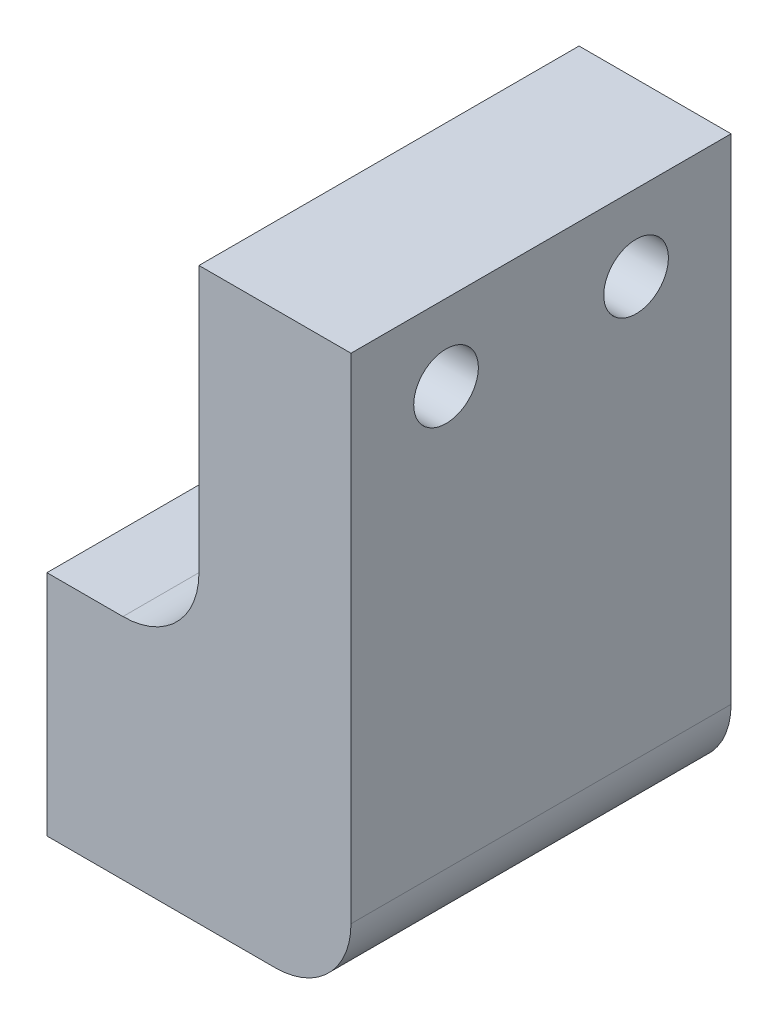
ISO-10303-21;
HEADER;
FILE_DESCRIPTION(('STEP AP214'),'2;1');
FILE_NAME('part.step','',(''),(''),'','','');
FILE_SCHEMA(('AUTOMOTIVE_DESIGN { 1 0 10303 214 1 1 1 1 }'));
ENDSEC;
DATA;
#1=APPLICATION_CONTEXT('core data for automotive mechanical design processes');
#2=APPLICATION_PROTOCOL_DEFINITION('international standard','automotive_design',2000,#1);
#3=PRODUCT_CONTEXT('',#1,'mechanical');
#4=PRODUCT('Part','Part','',(#3));
#5=PRODUCT_RELATED_PRODUCT_CATEGORY('part','',(#4));
#6=PRODUCT_DEFINITION_FORMATION('','',#4);
#7=PRODUCT_DEFINITION_CONTEXT('part definition',#1,'design');
#8=PRODUCT_DEFINITION('design','',#6,#7);
#9=PRODUCT_DEFINITION_SHAPE('','',#8);
#10=(LENGTH_UNIT() NAMED_UNIT(*) SI_UNIT(.MILLI.,.METRE.));
#11=(NAMED_UNIT(*) PLANE_ANGLE_UNIT() SI_UNIT($,.RADIAN.));
#12=(NAMED_UNIT(*) SI_UNIT($,.STERADIAN.) SOLID_ANGLE_UNIT());
#13=UNCERTAINTY_MEASURE_WITH_UNIT(LENGTH_MEASURE(1.E-05),#10,'distance_accuracy_value','');
#14=(GEOMETRIC_REPRESENTATION_CONTEXT(3) GLOBAL_UNCERTAINTY_ASSIGNED_CONTEXT((#13)) GLOBAL_UNIT_ASSIGNED_CONTEXT((#10,
#11,#12)) REPRESENTATION_CONTEXT('',''));
#15=CARTESIAN_POINT('',(0.,0.,0.));
#16=DIRECTION('',(0.,0.,1.));
#17=DIRECTION('',(1.,0.,0.));
#18=AXIS2_PLACEMENT_3D('',#15,#16,#17);
#19=CARTESIAN_POINT('',(0.,0.,0.));
#20=DIRECTION('',(1.,0.,0.));
#21=DIRECTION('',(0.,0.,-1.));
#22=AXIS2_PLACEMENT_3D('',#19,#20,#21);
#23=PLANE('',#22);
#24=CARTESIAN_POINT('',(0.,0.,-5.));
#25=DIRECTION('',(-1.,0.,0.));
#26=DIRECTION('',(0.,0.,1.));
#27=AXIS2_PLACEMENT_3D('',#24,#25,#26);
#28=CIRCLE('',#27,1.7);
#29=CARTESIAN_POINT('',(0.,0.,-3.3));
#30=VERTEX_POINT('',#29);
#31=EDGE_CURVE('E165',#30,#30,#28,.T.);
#32=ORIENTED_EDGE('',*,*,#31,.F.);
#33=EDGE_LOOP('',(#32));
#34=FACE_BOUND('',#33,.T.);
#35=CARTESIAN_POINT('',(0.,0.,5.));
#36=DIRECTION('',(-1.,0.,0.));
#37=DIRECTION('',(0.,0.,1.));
#38=AXIS2_PLACEMENT_3D('',#35,#36,#37);
#39=CIRCLE('',#38,1.7);
#40=CARTESIAN_POINT('',(0.,0.,6.69999999999999));
#41=VERTEX_POINT('',#40);
#42=EDGE_CURVE('E122',#41,#41,#39,.T.);
#43=ORIENTED_EDGE('',*,*,#42,.F.);
#44=EDGE_LOOP('',(#43));
#45=FACE_BOUND('',#44,.T.);
#46=DIRECTION('',(0.,-1.,0.));
#47=VECTOR('',#46,1.);
#48=CARTESIAN_POINT('',(0.,0.,-10.));
#49=LINE('',#48,#47);
#50=CARTESIAN_POINT('',(0.,6.,-10.));
#51=VERTEX_POINT('',#50);
#52=CARTESIAN_POINT('',(0.,-6.,-10.));
#53=VERTEX_POINT('',#52);
#54=EDGE_CURVE('E11',#51,#53,#49,.T.);
#55=ORIENTED_EDGE('',*,*,#54,.T.);
#56=DIRECTION('',(0.,0.,-1.));
#57=VECTOR('',#56,1.);
#58=CARTESIAN_POINT('',(0.,-6.,10.));
#59=LINE('',#58,#57);
#60=CARTESIAN_POINT('',(0.,-6.,10.));
#61=VERTEX_POINT('',#60);
#62=EDGE_CURVE('E151',#61,#53,#59,.T.);
#63=ORIENTED_EDGE('',*,*,#62,.F.);
#64=DIRECTION('',(0.,-1.,0.));
#65=VECTOR('',#64,1.);
#66=CARTESIAN_POINT('',(0.,0.,10.));
#67=LINE('',#66,#65);
#68=CARTESIAN_POINT('',(0.,6.,10.));
#69=VERTEX_POINT('',#68);
#70=EDGE_CURVE('E183',#69,#61,#67,.T.);
#71=ORIENTED_EDGE('',*,*,#70,.F.);
#72=DIRECTION('',(0.,0.,1.));
#73=VECTOR('',#72,1.);
#74=CARTESIAN_POINT('',(0.,6.,10.));
#75=LINE('',#74,#73);
#76=EDGE_CURVE('E42',#51,#69,#75,.T.);
#77=ORIENTED_EDGE('',*,*,#76,.F.);
#78=EDGE_LOOP('',(#55,#63,#71,#77));
#79=FACE_BOUND('',#78,.T.);
#80=ADVANCED_FACE('F39',(#34,#45,#79),#23,.F.);
#81=CARTESIAN_POINT('',(4.24892422621555,0.,-5.));
#82=DIRECTION('',(-1.,0.,0.));
#83=DIRECTION('',(0.,0.,1.));
#84=AXIS2_PLACEMENT_3D('',#81,#82,#83);
#85=CONICAL_SURFACE('',#84,1.25,1.02974425867665);
#86=CARTESIAN_POINT('',(5.,0.,-5.));
#87=VERTEX_POINT('',#86);
#88=VERTEX_LOOP('',#87);
#89=FACE_BOUND('',#88,.T.);
#90=CARTESIAN_POINT('',(4.24892422621555,0.,-5.));
#91=DIRECTION('',(-1.,0.,0.));
#92=DIRECTION('',(0.,0.,1.));
#93=AXIS2_PLACEMENT_3D('',#90,#91,#92);
#94=CIRCLE('',#93,1.25);
#95=CARTESIAN_POINT('',(4.24892422621555,0.,-3.75));
#96=VERTEX_POINT('',#95);
#97=EDGE_CURVE('E113',#96,#96,#94,.T.);
#98=ORIENTED_EDGE('',*,*,#97,.T.);
#99=EDGE_LOOP('',(#98));
#100=FACE_BOUND('',#99,.T.);
#101=ADVANCED_FACE('F106',(#89,#100),#85,.F.);
#102=CARTESIAN_POINT('',(-9.,0.,-5.));
#103=DIRECTION('',(-1.,0.,0.));
#104=DIRECTION('',(0.,0.,1.));
#105=AXIS2_PLACEMENT_3D('',#102,#103,#104);
#106=CYLINDRICAL_SURFACE('',#105,1.25);
#107=CARTESIAN_POINT('',(0.270387278562402,0.,-5.));
#108=DIRECTION('',(-1.,0.,0.));
#109=DIRECTION('',(0.,0.,1.));
#110=AXIS2_PLACEMENT_3D('',#107,#108,#109);
#111=CIRCLE('',#110,1.25);
#112=CARTESIAN_POINT('',(0.270387278562402,0.,-3.75));
#113=VERTEX_POINT('',#112);
#114=EDGE_CURVE('E162',#113,#113,#111,.T.);
#115=ORIENTED_EDGE('',*,*,#114,.T.);
#116=EDGE_LOOP('',(#115));
#117=FACE_BOUND('',#116,.T.);
#118=ORIENTED_EDGE('',*,*,#97,.F.);
#119=EDGE_LOOP('',(#118));
#120=FACE_BOUND('',#119,.T.);
#121=ADVANCED_FACE('F109',(#117,#120),#106,.F.);
#122=CARTESIAN_POINT('',(0.,0.,-5.));
#123=DIRECTION('',(-1.,0.,0.));
#124=DIRECTION('',(0.,0.,1.));
#125=AXIS2_PLACEMENT_3D('',#122,#123,#124);
#126=CONICAL_SURFACE('',#125,1.7,1.02974425867665);
#127=ORIENTED_EDGE('',*,*,#31,.T.);
#128=EDGE_LOOP('',(#127));
#129=FACE_BOUND('',#128,.T.);
#130=ORIENTED_EDGE('',*,*,#114,.F.);
#131=EDGE_LOOP('',(#130));
#132=FACE_BOUND('',#131,.T.);
#133=ADVANCED_FACE('F273',(#129,#132),#126,.F.);
#134=CARTESIAN_POINT('',(4.24892422621555,0.,5.));
#135=DIRECTION('',(-1.,0.,0.));
#136=DIRECTION('',(0.,0.,1.));
#137=AXIS2_PLACEMENT_3D('',#134,#135,#136);
#138=CONICAL_SURFACE('',#137,1.25,1.02974425867665);
#139=CARTESIAN_POINT('',(5.,0.,5.));
#140=VERTEX_POINT('',#139);
#141=VERTEX_LOOP('',#140);
#142=FACE_BOUND('',#141,.T.);
#143=CARTESIAN_POINT('',(4.24892422621555,0.,5.));
#144=DIRECTION('',(-1.,0.,0.));
#145=DIRECTION('',(0.,0.,1.));
#146=AXIS2_PLACEMENT_3D('',#143,#144,#145);
#147=CIRCLE('',#146,1.25);
#148=CARTESIAN_POINT('',(4.24892422621555,0.,6.24999999999999));
#149=VERTEX_POINT('',#148);
#150=EDGE_CURVE('E115',#149,#149,#147,.T.);
#151=ORIENTED_EDGE('',*,*,#150,.T.);
#152=EDGE_LOOP('',(#151));
#153=FACE_BOUND('',#152,.T.);
#154=ADVANCED_FACE('F276',(#142,#153),#138,.F.);
#155=CARTESIAN_POINT('',(-9.,0.,5.));
#156=DIRECTION('',(-1.,0.,0.));
#157=DIRECTION('',(0.,0.,1.));
#158=AXIS2_PLACEMENT_3D('',#155,#156,#157);
#159=CYLINDRICAL_SURFACE('',#158,1.25);
#160=CARTESIAN_POINT('',(0.270387278562402,0.,5.));
#161=DIRECTION('',(-1.,0.,0.));
#162=DIRECTION('',(0.,0.,1.));
#163=AXIS2_PLACEMENT_3D('',#160,#161,#162);
#164=CIRCLE('',#163,1.25);
#165=CARTESIAN_POINT('',(0.270387278562402,0.,6.25));
#166=VERTEX_POINT('',#165);
#167=EDGE_CURVE('E116',#166,#166,#164,.T.);
#168=ORIENTED_EDGE('',*,*,#167,.T.);
#169=EDGE_LOOP('',(#168));
#170=FACE_BOUND('',#169,.T.);
#171=ORIENTED_EDGE('',*,*,#150,.F.);
#172=EDGE_LOOP('',(#171));
#173=FACE_BOUND('',#172,.T.);
#174=ADVANCED_FACE('F280',(#170,#173),#159,.F.);
#175=CARTESIAN_POINT('',(0.,0.,5.));
#176=DIRECTION('',(-1.,0.,0.));
#177=DIRECTION('',(0.,0.,1.));
#178=AXIS2_PLACEMENT_3D('',#175,#176,#177);
#179=CONICAL_SURFACE('',#178,1.7,1.02974425867665);
#180=ORIENTED_EDGE('',*,*,#42,.T.);
#181=EDGE_LOOP('',(#180));
#182=FACE_BOUND('',#181,.T.);
#183=ORIENTED_EDGE('',*,*,#167,.F.);
#184=EDGE_LOOP('',(#183));
#185=FACE_BOUND('',#184,.T.);
#186=ADVANCED_FACE('F233',(#182,#185),#179,.F.);
#187=CARTESIAN_POINT('',(16.,14.,10.));
#188=DIRECTION('',(-1.,0.,0.));
#189=DIRECTION('',(0.,0.,1.));
#190=AXIS2_PLACEMENT_3D('',#187,#188,#189);
#191=PLANE('',#190);
#192=CARTESIAN_POINT('',(16.,19.9950000000001,-5.));
#193=DIRECTION('',(-1.,0.,0.));
#194=DIRECTION('',(0.,0.,1.));
#195=AXIS2_PLACEMENT_3D('',#192,#193,#194);
#196=CIRCLE('',#195,1.69999999999995);
#197=CARTESIAN_POINT('',(16.,19.9950000000001,-3.30000000000005));
#198=VERTEX_POINT('',#197);
#199=EDGE_CURVE('E188',#198,#198,#196,.T.);
#200=ORIENTED_EDGE('',*,*,#199,.T.);
#201=EDGE_LOOP('',(#200));
#202=FACE_BOUND('',#201,.T.);
#203=CARTESIAN_POINT('',(16.,19.9950000000001,5.));
#204=DIRECTION('',(-1.,0.,0.));
#205=DIRECTION('',(0.,0.,1.));
#206=AXIS2_PLACEMENT_3D('',#203,#204,#205);
#207=CIRCLE('',#206,1.69999999999995);
#208=CARTESIAN_POINT('',(16.,19.9950000000001,6.69999999999995));
#209=VERTEX_POINT('',#208);
#210=EDGE_CURVE('E184',#209,#209,#207,.T.);
#211=ORIENTED_EDGE('',*,*,#210,.T.);
#212=EDGE_LOOP('',(#211));
#213=FACE_BOUND('',#212,.T.);
#214=DIRECTION('',(0.,1.,0.));
#215=VECTOR('',#214,1.);
#216=CARTESIAN_POINT('',(16.,14.,10.));
#217=LINE('',#216,#215);
#218=CARTESIAN_POINT('',(16.,-2.,10.));
#219=VERTEX_POINT('',#218);
#220=CARTESIAN_POINT('',(16.,24.,10.));
#221=VERTEX_POINT('',#220);
#222=EDGE_CURVE('E139',#219,#221,#217,.T.);
#223=ORIENTED_EDGE('',*,*,#222,.F.);
#224=DIRECTION('',(0.,0.,-1.));
#225=VECTOR('',#224,1.);
#226=CARTESIAN_POINT('',(16.,-2.,10.));
#227=LINE('',#226,#225);
#228=CARTESIAN_POINT('',(16.,-2.,-10.));
#229=VERTEX_POINT('',#228);
#230=EDGE_CURVE('E160',#219,#229,#227,.T.);
#231=ORIENTED_EDGE('',*,*,#230,.T.);
#232=DIRECTION('',(0.,1.,0.));
#233=VECTOR('',#232,1.);
#234=CARTESIAN_POINT('',(16.,14.,-10.));
#235=LINE('',#234,#233);
#236=CARTESIAN_POINT('',(16.,24.,-10.));
#237=VERTEX_POINT('',#236);
#238=EDGE_CURVE('E130',#229,#237,#235,.T.);
#239=ORIENTED_EDGE('',*,*,#238,.T.);
#240=DIRECTION('',(0.,0.,-1.));
#241=VECTOR('',#240,1.);
#242=CARTESIAN_POINT('',(16.,24.,10.));
#243=LINE('',#242,#241);
#244=EDGE_CURVE('E119',#221,#237,#243,.T.);
#245=ORIENTED_EDGE('',*,*,#244,.F.);
#246=EDGE_LOOP('',(#223,#231,#239,#245));
#247=FACE_BOUND('',#246,.T.);
#248=ADVANCED_FACE('F208',(#202,#213,#247),#191,.F.);
#249=CARTESIAN_POINT('',(8.,6.,10.));
#250=DIRECTION('',(1.,0.,0.));
#251=DIRECTION('',(0.,0.,-1.));
#252=AXIS2_PLACEMENT_3D('',#249,#250,#251);
#253=PLANE('',#252);
#254=CARTESIAN_POINT('',(8.,19.9950000000001,-5.));
#255=DIRECTION('',(-1.,0.,0.));
#256=DIRECTION('',(0.,0.,1.));
#257=AXIS2_PLACEMENT_3D('',#254,#255,#256);
#258=CIRCLE('',#257,3.25);
#259=CARTESIAN_POINT('',(8.,19.9950000000001,-1.75));
#260=VERTEX_POINT('',#259);
#261=EDGE_CURVE('E539',#260,#260,#258,.T.);
#262=ORIENTED_EDGE('',*,*,#261,.F.);
#263=EDGE_LOOP('',(#262));
#264=FACE_BOUND('',#263,.T.);
#265=CARTESIAN_POINT('',(8.,19.9950000000001,5.));
#266=DIRECTION('',(-1.,0.,0.));
#267=DIRECTION('',(0.,0.,1.));
#268=AXIS2_PLACEMENT_3D('',#265,#266,#267);
#269=CIRCLE('',#268,3.25);
#270=CARTESIAN_POINT('',(8.,19.9950000000001,8.24999999999999));
#271=VERTEX_POINT('',#270);
#272=EDGE_CURVE('E190',#271,#271,#269,.T.);
#273=ORIENTED_EDGE('',*,*,#272,.F.);
#274=EDGE_LOOP('',(#273));
#275=FACE_BOUND('',#274,.T.);
#276=DIRECTION('',(0.,-1.,0.));
#277=VECTOR('',#276,1.);
#278=CARTESIAN_POINT('',(8.,6.,-10.));
#279=LINE('',#278,#277);
#280=CARTESIAN_POINT('',(8.,24.,-10.));
#281=VERTEX_POINT('',#280);
#282=CARTESIAN_POINT('',(8.,10.,-10.));
#283=VERTEX_POINT('',#282);
#284=EDGE_CURVE('E153',#281,#283,#279,.T.);
#285=ORIENTED_EDGE('',*,*,#284,.T.);
#286=DIRECTION('',(0.,0.,-1.));
#287=VECTOR('',#286,1.);
#288=CARTESIAN_POINT('',(8.,10.,10.));
#289=LINE('',#288,#287);
#290=CARTESIAN_POINT('',(8.,10.,10.));
#291=VERTEX_POINT('',#290);
#292=EDGE_CURVE('E177',#283,#291,#289,.F.);
#293=ORIENTED_EDGE('',*,*,#292,.T.);
#294=DIRECTION('',(0.,-1.,0.));
#295=VECTOR('',#294,1.);
#296=CARTESIAN_POINT('',(8.,6.,10.));
#297=LINE('',#296,#295);
#298=CARTESIAN_POINT('',(8.,24.,10.));
#299=VERTEX_POINT('',#298);
#300=EDGE_CURVE('E141',#299,#291,#297,.T.);
#301=ORIENTED_EDGE('',*,*,#300,.F.);
#302=DIRECTION('',(0.,0.,1.));
#303=VECTOR('',#302,1.);
#304=CARTESIAN_POINT('',(8.,24.,10.));
#305=LINE('',#304,#303);
#306=EDGE_CURVE('E127',#281,#299,#305,.T.);
#307=ORIENTED_EDGE('',*,*,#306,.F.);
#308=EDGE_LOOP('',(#285,#293,#301,#307));
#309=FACE_BOUND('',#308,.T.);
#310=ADVANCED_FACE('F224',(#264,#275,#309),#253,.F.);
#311=CARTESIAN_POINT('',(0.,6.,10.));
#312=DIRECTION('',(0.,-1.,0.));
#313=DIRECTION('',(0.,0.,-1.));
#314=AXIS2_PLACEMENT_3D('',#311,#312,#313);
#315=PLANE('',#314);
#316=DIRECTION('',(-1.,0.,0.));
#317=VECTOR('',#316,1.);
#318=CARTESIAN_POINT('',(0.,6.,-10.));
#319=LINE('',#318,#317);
#320=CARTESIAN_POINT('',(4.,6.,-10.));
#321=VERTEX_POINT('',#320);
#322=EDGE_CURVE('E156',#321,#51,#319,.T.);
#323=ORIENTED_EDGE('',*,*,#322,.T.);
#324=ORIENTED_EDGE('',*,*,#76,.T.);
#325=DIRECTION('',(-1.,0.,0.));
#326=VECTOR('',#325,1.);
#327=CARTESIAN_POINT('',(0.,6.,10.));
#328=LINE('',#327,#326);
#329=CARTESIAN_POINT('',(4.,6.,10.));
#330=VERTEX_POINT('',#329);
#331=EDGE_CURVE('E145',#330,#69,#328,.T.);
#332=ORIENTED_EDGE('',*,*,#331,.F.);
#333=DIRECTION('',(0.,0.,-1.));
#334=VECTOR('',#333,1.);
#335=CARTESIAN_POINT('',(4.,6.,-10.));
#336=LINE('',#335,#334);
#337=EDGE_CURVE('E174',#330,#321,#336,.T.);
#338=ORIENTED_EDGE('',*,*,#337,.T.);
#339=EDGE_LOOP('',(#323,#324,#332,#338));
#340=FACE_BOUND('',#339,.T.);
#341=ADVANCED_FACE('F221',(#340),#315,.F.);
#342=CARTESIAN_POINT('',(16.,-6.,10.));
#343=DIRECTION('',(0.,1.,0.));
#344=DIRECTION('',(0.,0.,1.));
#345=AXIS2_PLACEMENT_3D('',#342,#343,#344);
#346=PLANE('',#345);
#347=DIRECTION('',(1.,0.,0.));
#348=VECTOR('',#347,1.);
#349=CARTESIAN_POINT('',(16.,-6.,-10.));
#350=LINE('',#349,#348);
#351=CARTESIAN_POINT('',(12.,-6.,-10.));
#352=VERTEX_POINT('',#351);
#353=EDGE_CURVE('E142',#53,#352,#350,.T.);
#354=ORIENTED_EDGE('',*,*,#353,.T.);
#355=DIRECTION('',(0.,0.,-1.));
#356=VECTOR('',#355,1.);
#357=CARTESIAN_POINT('',(12.,-6.,10.));
#358=LINE('',#357,#356);
#359=CARTESIAN_POINT('',(12.,-6.,10.));
#360=VERTEX_POINT('',#359);
#361=EDGE_CURVE('E170',#352,#360,#358,.F.);
#362=ORIENTED_EDGE('',*,*,#361,.T.);
#363=DIRECTION('',(1.,0.,0.));
#364=VECTOR('',#363,1.);
#365=CARTESIAN_POINT('',(16.,-6.,10.));
#366=LINE('',#365,#364);
#367=EDGE_CURVE('E148',#61,#360,#366,.T.);
#368=ORIENTED_EDGE('',*,*,#367,.F.);
#369=ORIENTED_EDGE('',*,*,#62,.T.);
#370=EDGE_LOOP('',(#354,#362,#368,#369));
#371=FACE_BOUND('',#370,.T.);
#372=ADVANCED_FACE('F199',(#371),#346,.F.);
#373=CARTESIAN_POINT('',(0.,0.,10.));
#374=DIRECTION('',(0.,0.,-1.));
#375=DIRECTION('',(-1.,0.,0.));
#376=AXIS2_PLACEMENT_3D('',#373,#374,#375);
#377=PLANE('',#376);
#378=ORIENTED_EDGE('',*,*,#331,.T.);
#379=ORIENTED_EDGE('',*,*,#70,.T.);
#380=ORIENTED_EDGE('',*,*,#367,.T.);
#381=CARTESIAN_POINT('',(12.,-2.,10.));
#382=DIRECTION('',(0.,0.,-1.));
#383=DIRECTION('',(-1.,0.,0.));
#384=AXIS2_PLACEMENT_3D('',#381,#382,#383);
#385=CIRCLE('',#384,4.);
#386=EDGE_CURVE('E172',#360,#219,#385,.F.);
#387=ORIENTED_EDGE('',*,*,#386,.T.);
#388=ORIENTED_EDGE('',*,*,#222,.T.);
#389=DIRECTION('',(1.,0.,0.));
#390=VECTOR('',#389,1.);
#391=CARTESIAN_POINT('',(-14.3606797749979,24.,10.));
#392=LINE('',#391,#390);
#393=EDGE_CURVE('E134',#299,#221,#392,.T.);
#394=ORIENTED_EDGE('',*,*,#393,.F.);
#395=ORIENTED_EDGE('',*,*,#300,.T.);
#396=CARTESIAN_POINT('',(4.,10.,10.));
#397=DIRECTION('',(0.,0.,-1.));
#398=DIRECTION('',(-1.,0.,0.));
#399=AXIS2_PLACEMENT_3D('',#396,#397,#398);
#400=CIRCLE('',#399,4.);
#401=EDGE_CURVE('E181',#291,#330,#400,.T.);
#402=ORIENTED_EDGE('',*,*,#401,.T.);
#403=EDGE_LOOP('',(#378,#379,#380,#387,#388,#394,#395,#402));
#404=FACE_BOUND('',#403,.T.);
#405=ADVANCED_FACE('F194',(#404),#377,.F.);
#406=CARTESIAN_POINT('',(0.,0.,-10.));
#407=DIRECTION('',(0.,0.,-1.));
#408=DIRECTION('',(-1.,0.,0.));
#409=AXIS2_PLACEMENT_3D('',#406,#407,#408);
#410=PLANE('',#409);
#411=ORIENTED_EDGE('',*,*,#54,.F.);
#412=ORIENTED_EDGE('',*,*,#322,.F.);
#413=CARTESIAN_POINT('',(4.,10.,-10.));
#414=DIRECTION('',(0.,0.,-1.));
#415=DIRECTION('',(-1.,0.,0.));
#416=AXIS2_PLACEMENT_3D('',#413,#414,#415);
#417=CIRCLE('',#416,4.);
#418=EDGE_CURVE('E179',#321,#283,#417,.F.);
#419=ORIENTED_EDGE('',*,*,#418,.T.);
#420=ORIENTED_EDGE('',*,*,#284,.F.);
#421=DIRECTION('',(1.,0.,0.));
#422=VECTOR('',#421,1.);
#423=CARTESIAN_POINT('',(-14.3606797749979,24.,-10.));
#424=LINE('',#423,#422);
#425=EDGE_CURVE('E131',#281,#237,#424,.T.);
#426=ORIENTED_EDGE('',*,*,#425,.T.);
#427=ORIENTED_EDGE('',*,*,#238,.F.);
#428=CARTESIAN_POINT('',(12.,-2.,-10.));
#429=DIRECTION('',(0.,0.,-1.));
#430=DIRECTION('',(-1.,0.,0.));
#431=AXIS2_PLACEMENT_3D('',#428,#429,#430);
#432=CIRCLE('',#431,4.);
#433=EDGE_CURVE('E168',#229,#352,#432,.T.);
#434=ORIENTED_EDGE('',*,*,#433,.T.);
#435=ORIENTED_EDGE('',*,*,#353,.F.);
#436=EDGE_LOOP('',(#411,#412,#419,#420,#426,#427,#434,#435));
#437=FACE_BOUND('',#436,.T.);
#438=ADVANCED_FACE('F223',(#437),#410,.T.);
#439=CARTESIAN_POINT('',(-14.3606797749979,24.,10.));
#440=DIRECTION('',(0.,-1.,0.));
#441=DIRECTION('',(1.,0.,0.));
#442=AXIS2_PLACEMENT_3D('',#439,#440,#441);
#443=PLANE('',#442);
#444=ORIENTED_EDGE('',*,*,#425,.F.);
#445=ORIENTED_EDGE('',*,*,#306,.T.);
#446=ORIENTED_EDGE('',*,*,#393,.T.);
#447=ORIENTED_EDGE('',*,*,#244,.T.);
#448=EDGE_LOOP('',(#444,#445,#446,#447));
#449=FACE_BOUND('',#448,.T.);
#450=ADVANCED_FACE('F212',(#449),#443,.F.);
#451=CARTESIAN_POINT('',(12.,-2.,10.));
#452=DIRECTION('',(0.,0.,-1.));
#453=DIRECTION('',(-1.,0.,0.));
#454=AXIS2_PLACEMENT_3D('',#451,#452,#453);
#455=CYLINDRICAL_SURFACE('',#454,4.);
#456=ORIENTED_EDGE('',*,*,#386,.F.);
#457=ORIENTED_EDGE('',*,*,#361,.F.);
#458=ORIENTED_EDGE('',*,*,#433,.F.);
#459=ORIENTED_EDGE('',*,*,#230,.F.);
#460=EDGE_LOOP('',(#456,#457,#458,#459));
#461=FACE_BOUND('',#460,.T.);
#462=ADVANCED_FACE('F202',(#461),#455,.T.);
#463=CARTESIAN_POINT('',(4.,10.,10.));
#464=DIRECTION('',(0.,0.,1.));
#465=DIRECTION('',(1.,0.,0.));
#466=AXIS2_PLACEMENT_3D('',#463,#464,#465);
#467=CYLINDRICAL_SURFACE('',#466,4.);
#468=ORIENTED_EDGE('',*,*,#401,.F.);
#469=ORIENTED_EDGE('',*,*,#292,.F.);
#470=ORIENTED_EDGE('',*,*,#418,.F.);
#471=ORIENTED_EDGE('',*,*,#337,.F.);
#472=EDGE_LOOP('',(#468,#469,#470,#471));
#473=FACE_BOUND('',#472,.T.);
#474=ADVANCED_FACE('F219',(#473),#467,.F.);
#475=CARTESIAN_POINT('',(8.,19.9950000000001,5.));
#476=DIRECTION('',(-1.,0.,0.));
#477=DIRECTION('',(0.,0.,1.));
#478=AXIS2_PLACEMENT_3D('',#475,#476,#477);
#479=CYLINDRICAL_SURFACE('',#478,1.69999999999995);
#480=CARTESIAN_POINT('',(11.,19.9950000000001,5.));
#481=DIRECTION('',(-1.,0.,0.));
#482=DIRECTION('',(0.,0.,1.));
#483=AXIS2_PLACEMENT_3D('',#480,#481,#482);
#484=CIRCLE('',#483,1.69999999999991);
#485=CARTESIAN_POINT('',(11.,19.9950000000001,6.6999999999999));
#486=VERTEX_POINT('',#485);
#487=EDGE_CURVE('E187',#486,#486,#484,.T.);
#488=ORIENTED_EDGE('',*,*,#487,.T.);
#489=EDGE_LOOP('',(#488));
#490=FACE_BOUND('',#489,.T.);
#491=ORIENTED_EDGE('',*,*,#210,.F.);
#492=EDGE_LOOP('',(#491));
#493=FACE_BOUND('',#492,.T.);
#494=ADVANCED_FACE('F268',(#490,#493),#479,.F.);
#495=CARTESIAN_POINT('',(11.,21.695,5.));
#496=DIRECTION('',(1.,0.,0.));
#497=DIRECTION('',(0.,0.,-1.));
#498=AXIS2_PLACEMENT_3D('',#495,#496,#497);
#499=PLANE('',#498);
#500=ORIENTED_EDGE('',*,*,#487,.F.);
#501=EDGE_LOOP('',(#500));
#502=FACE_BOUND('',#501,.T.);
#503=CARTESIAN_POINT('',(11.,19.9950000000001,5.));
#504=DIRECTION('',(-1.,0.,0.));
#505=DIRECTION('',(0.,0.,1.));
#506=AXIS2_PLACEMENT_3D('',#503,#504,#505);
#507=CIRCLE('',#506,3.25);
#508=CARTESIAN_POINT('',(11.,19.9950000000001,8.24999999999999));
#509=VERTEX_POINT('',#508);
#510=EDGE_CURVE('E529',#509,#509,#507,.T.);
#511=ORIENTED_EDGE('',*,*,#510,.T.);
#512=EDGE_LOOP('',(#511));
#513=FACE_BOUND('',#512,.T.);
#514=ADVANCED_FACE('F264',(#502,#513),#499,.F.);
#515=CARTESIAN_POINT('',(8.,19.9950000000001,5.));
#516=DIRECTION('',(-1.,0.,0.));
#517=DIRECTION('',(0.,0.,1.));
#518=AXIS2_PLACEMENT_3D('',#515,#516,#517);
#519=CYLINDRICAL_SURFACE('',#518,3.25);
#520=ORIENTED_EDGE('',*,*,#510,.F.);
#521=EDGE_LOOP('',(#520));
#522=FACE_BOUND('',#521,.T.);
#523=ORIENTED_EDGE('',*,*,#272,.T.);
#524=EDGE_LOOP('',(#523));
#525=FACE_BOUND('',#524,.T.);
#526=ADVANCED_FACE('F260',(#522,#525),#519,.F.);
#527=CARTESIAN_POINT('',(8.,19.9950000000001,-5.));
#528=DIRECTION('',(-1.,0.,0.));
#529=DIRECTION('',(0.,0.,1.));
#530=AXIS2_PLACEMENT_3D('',#527,#528,#529);
#531=CYLINDRICAL_SURFACE('',#530,1.69999999999995);
#532=CARTESIAN_POINT('',(11.,19.9950000000001,-5.));
#533=DIRECTION('',(-1.,0.,0.));
#534=DIRECTION('',(0.,0.,1.));
#535=AXIS2_PLACEMENT_3D('',#532,#533,#534);
#536=CIRCLE('',#535,1.69999999999991);
#537=CARTESIAN_POINT('',(11.,19.9950000000001,-3.30000000000009));
#538=VERTEX_POINT('',#537);
#539=EDGE_CURVE('E191',#538,#538,#536,.T.);
#540=ORIENTED_EDGE('',*,*,#539,.T.);
#541=EDGE_LOOP('',(#540));
#542=FACE_BOUND('',#541,.T.);
#543=ORIENTED_EDGE('',*,*,#199,.F.);
#544=EDGE_LOOP('',(#543));
#545=FACE_BOUND('',#544,.T.);
#546=ADVANCED_FACE('F252',(#542,#545),#531,.F.);
#547=CARTESIAN_POINT('',(11.,21.695,-5.));
#548=DIRECTION('',(1.,0.,0.));
#549=DIRECTION('',(0.,0.,-1.));
#550=AXIS2_PLACEMENT_3D('',#547,#548,#549);
#551=PLANE('',#550);
#552=ORIENTED_EDGE('',*,*,#539,.F.);
#553=EDGE_LOOP('',(#552));
#554=FACE_BOUND('',#553,.T.);
#555=CARTESIAN_POINT('',(11.,19.9950000000001,-5.));
#556=DIRECTION('',(-1.,0.,0.));
#557=DIRECTION('',(0.,0.,1.));
#558=AXIS2_PLACEMENT_3D('',#555,#556,#557);
#559=CIRCLE('',#558,3.25);
#560=CARTESIAN_POINT('',(11.,19.9950000000001,-1.75));
#561=VERTEX_POINT('',#560);
#562=EDGE_CURVE('E536',#561,#561,#559,.T.);
#563=ORIENTED_EDGE('',*,*,#562,.T.);
#564=EDGE_LOOP('',(#563));
#565=FACE_BOUND('',#564,.T.);
#566=ADVANCED_FACE('F246',(#554,#565),#551,.F.);
#567=CARTESIAN_POINT('',(8.,19.9950000000001,-5.));
#568=DIRECTION('',(-1.,0.,0.));
#569=DIRECTION('',(0.,0.,1.));
#570=AXIS2_PLACEMENT_3D('',#567,#568,#569);
#571=CYLINDRICAL_SURFACE('',#570,3.25);
#572=ORIENTED_EDGE('',*,*,#562,.F.);
#573=EDGE_LOOP('',(#572));
#574=FACE_BOUND('',#573,.T.);
#575=ORIENTED_EDGE('',*,*,#261,.T.);
#576=EDGE_LOOP('',(#575));
#577=FACE_BOUND('',#576,.T.);
#578=ADVANCED_FACE('F240',(#574,#577),#571,.F.);
#579=CLOSED_SHELL('',(#80,#101,#121,#133,#154,#174,#186,#248,#310,#341,#372,#405,#438,#450,#462,
#474,#494,#514,#526,#546,#566,#578));
#580=MANIFOLD_SOLID_BREP('B2',#579);
#581=ADVANCED_BREP_SHAPE_REPRESENTATION('',(#18,#580),#14);
#582=SHAPE_DEFINITION_REPRESENTATION(#9,#581);
ENDSEC;
END-ISO-10303-21;
